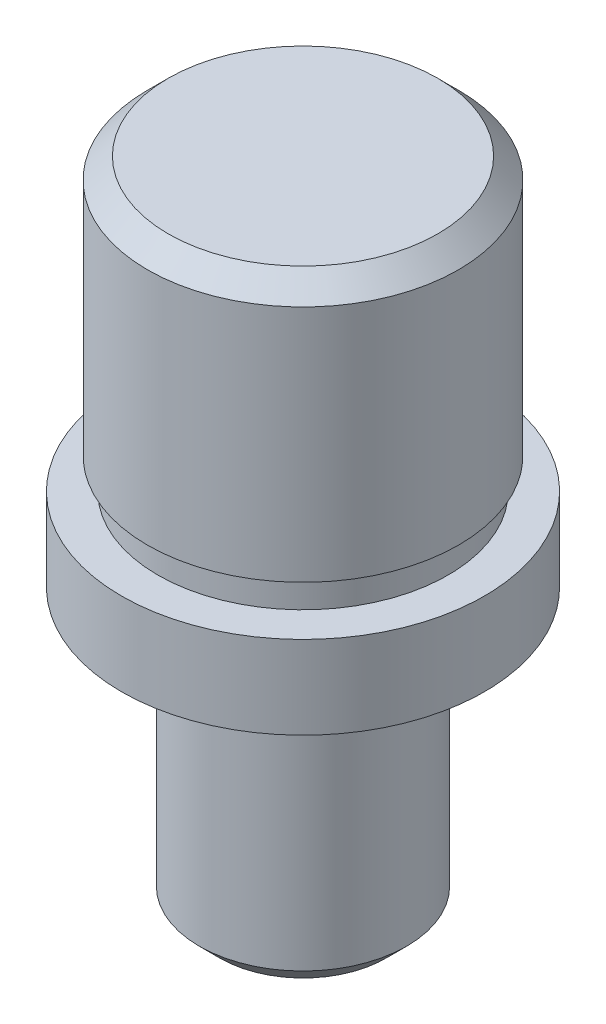
ISO-10303-21;
HEADER;
FILE_DESCRIPTION(('STEP AP214'),'2;1');
FILE_NAME('part.step','',(''),(''),'','','');
FILE_SCHEMA(('AUTOMOTIVE_DESIGN { 1 0 10303 214 1 1 1 1 }'));
ENDSEC;
DATA;
#1=APPLICATION_CONTEXT('core data for automotive mechanical design processes');
#2=APPLICATION_PROTOCOL_DEFINITION('international standard','automotive_design',2000,#1);
#3=PRODUCT_CONTEXT('',#1,'mechanical');
#4=PRODUCT('Part','Part','',(#3));
#5=PRODUCT_RELATED_PRODUCT_CATEGORY('part','',(#4));
#6=PRODUCT_DEFINITION_FORMATION('','',#4);
#7=PRODUCT_DEFINITION_CONTEXT('part definition',#1,'design');
#8=PRODUCT_DEFINITION('design','',#6,#7);
#9=PRODUCT_DEFINITION_SHAPE('','',#8);
#10=(LENGTH_UNIT() NAMED_UNIT(*) SI_UNIT(.MILLI.,.METRE.));
#11=(NAMED_UNIT(*) PLANE_ANGLE_UNIT() SI_UNIT($,.RADIAN.));
#12=(NAMED_UNIT(*) SI_UNIT($,.STERADIAN.) SOLID_ANGLE_UNIT());
#13=UNCERTAINTY_MEASURE_WITH_UNIT(LENGTH_MEASURE(1.E-05),#10,'distance_accuracy_value','');
#14=(GEOMETRIC_REPRESENTATION_CONTEXT(3) GLOBAL_UNCERTAINTY_ASSIGNED_CONTEXT((#13)) GLOBAL_UNIT_ASSIGNED_CONTEXT((#10,
#11,#12)) REPRESENTATION_CONTEXT('',''));
#15=CARTESIAN_POINT('',(0.,0.,0.));
#16=DIRECTION('',(0.,0.,1.));
#17=DIRECTION('',(1.,0.,0.));
#18=AXIS2_PLACEMENT_3D('',#15,#16,#17);
#19=CARTESIAN_POINT('',(0.,63.,0.));
#20=DIRECTION('',(0.,-1.,0.));
#21=DIRECTION('',(0.,0.,-1.));
#22=AXIS2_PLACEMENT_3D('',#19,#20,#21);
#23=CYLINDRICAL_SURFACE('',#22,17.5);
#24=CARTESIAN_POINT('',(0.,35.,0.));
#25=DIRECTION('',(0.,1.,0.));
#26=DIRECTION('',(0.,0.,1.));
#27=AXIS2_PLACEMENT_3D('',#24,#25,#26);
#28=CIRCLE('',#27,17.5);
#29=CARTESIAN_POINT('',(0.,35.,17.5));
#30=VERTEX_POINT('',#29);
#31=EDGE_CURVE('E57',#30,#30,#28,.T.);
#32=ORIENTED_EDGE('',*,*,#31,.F.);
#33=EDGE_LOOP('',(#32));
#34=FACE_BOUND('',#33,.T.);
#35=CARTESIAN_POINT('',(0.,27.,0.));
#36=DIRECTION('',(0.,-1.,0.));
#37=DIRECTION('',(0.,0.,-1.));
#38=AXIS2_PLACEMENT_3D('',#35,#36,#37);
#39=CIRCLE('',#38,17.5);
#40=CARTESIAN_POINT('',(0.,27.,-17.5));
#41=VERTEX_POINT('',#40);
#42=EDGE_CURVE('E58',#41,#41,#39,.T.);
#43=ORIENTED_EDGE('',*,*,#42,.F.);
#44=EDGE_LOOP('',(#43));
#45=FACE_BOUND('',#44,.T.);
#46=ADVANCED_FACE('F37',(#34,#45),#23,.T.);
#47=CARTESIAN_POINT('',(0.,35.,0.));
#48=DIRECTION('',(0.,1.,0.));
#49=DIRECTION('',(0.,0.,1.));
#50=AXIS2_PLACEMENT_3D('',#47,#48,#49);
#51=PLANE('',#50);
#52=CARTESIAN_POINT('',(0.,35.,0.));
#53=DIRECTION('',(0.,1.,0.));
#54=DIRECTION('',(0.,0.,1.));
#55=AXIS2_PLACEMENT_3D('',#52,#53,#54);
#56=CIRCLE('',#55,14.);
#57=CARTESIAN_POINT('',(0.,35.,14.));
#58=VERTEX_POINT('',#57);
#59=EDGE_CURVE('E68',#58,#58,#56,.T.);
#60=ORIENTED_EDGE('',*,*,#59,.F.);
#61=EDGE_LOOP('',(#60));
#62=FACE_BOUND('',#61,.T.);
#63=ORIENTED_EDGE('',*,*,#31,.T.);
#64=EDGE_LOOP('',(#63));
#65=FACE_BOUND('',#64,.T.);
#66=ADVANCED_FACE('F94',(#62,#65),#51,.T.);
#67=CARTESIAN_POINT('',(0.,38.,0.));
#68=DIRECTION('',(0.,1.,0.));
#69=DIRECTION('',(0.,0.,1.));
#70=AXIS2_PLACEMENT_3D('',#67,#68,#69);
#71=PLANE('',#70);
#72=CARTESIAN_POINT('',(0.,38.,0.));
#73=DIRECTION('',(0.,1.,0.));
#74=DIRECTION('',(0.,0.,1.));
#75=AXIS2_PLACEMENT_3D('',#72,#73,#74);
#76=CIRCLE('',#75,15.);
#77=CARTESIAN_POINT('',(0.,38.,15.));
#78=VERTEX_POINT('',#77);
#79=EDGE_CURVE('E65',#78,#78,#76,.F.);
#80=ORIENTED_EDGE('',*,*,#79,.T.);
#81=EDGE_LOOP('',(#80));
#82=FACE_BOUND('',#81,.T.);
#83=CARTESIAN_POINT('',(0.,38.,0.));
#84=DIRECTION('',(0.,1.,0.));
#85=DIRECTION('',(0.,0.,1.));
#86=AXIS2_PLACEMENT_3D('',#83,#84,#85);
#87=CIRCLE('',#86,14.);
#88=CARTESIAN_POINT('',(0.,38.,14.));
#89=VERTEX_POINT('',#88);
#90=EDGE_CURVE('E61',#89,#89,#87,.T.);
#91=ORIENTED_EDGE('',*,*,#90,.T.);
#92=EDGE_LOOP('',(#91));
#93=FACE_BOUND('',#92,.T.);
#94=ADVANCED_FACE('F100',(#82,#93),#71,.F.);
#95=CARTESIAN_POINT('',(0.,35.,0.));
#96=DIRECTION('',(0.,1.,0.));
#97=DIRECTION('',(0.,0.,1.));
#98=AXIS2_PLACEMENT_3D('',#95,#96,#97);
#99=CYLINDRICAL_SURFACE('',#98,14.);
#100=ORIENTED_EDGE('',*,*,#59,.T.);
#101=EDGE_LOOP('',(#100));
#102=FACE_BOUND('',#101,.T.);
#103=ORIENTED_EDGE('',*,*,#90,.F.);
#104=EDGE_LOOP('',(#103));
#105=FACE_BOUND('',#104,.T.);
#106=ADVANCED_FACE('F123',(#102,#105),#99,.T.);
#107=CARTESIAN_POINT('',(0.,63.,0.));
#108=DIRECTION('',(0.,1.,0.));
#109=DIRECTION('',(0.,0.,1.));
#110=AXIS2_PLACEMENT_3D('',#107,#108,#109);
#111=PLANE('',#110);
#112=CARTESIAN_POINT('',(0.,63.,0.));
#113=DIRECTION('',(0.,1.,0.));
#114=DIRECTION('',(0.,0.,1.));
#115=AXIS2_PLACEMENT_3D('',#112,#113,#114);
#116=CIRCLE('',#115,13.);
#117=CARTESIAN_POINT('',(0.,63.,13.));
#118=VERTEX_POINT('',#117);
#119=EDGE_CURVE('E52',#118,#118,#116,.T.);
#120=ORIENTED_EDGE('',*,*,#119,.T.);
#121=EDGE_LOOP('',(#120));
#122=FACE_BOUND('',#121,.T.);
#123=ADVANCED_FACE('F121',(#122),#111,.T.);
#124=CARTESIAN_POINT('',(0.,38.,0.));
#125=DIRECTION('',(0.,1.,0.));
#126=DIRECTION('',(0.,0.,1.));
#127=AXIS2_PLACEMENT_3D('',#124,#125,#126);
#128=CYLINDRICAL_SURFACE('',#127,15.);
#129=CARTESIAN_POINT('',(0.,61.,0.));
#130=DIRECTION('',(0.,1.,0.));
#131=DIRECTION('',(0.,0.,1.));
#132=AXIS2_PLACEMENT_3D('',#129,#130,#131);
#133=CIRCLE('',#132,15.);
#134=CARTESIAN_POINT('',(0.,61.,15.));
#135=VERTEX_POINT('',#134);
#136=EDGE_CURVE('E48',#135,#135,#133,.F.);
#137=ORIENTED_EDGE('',*,*,#136,.T.);
#138=EDGE_LOOP('',(#137));
#139=FACE_BOUND('',#138,.T.);
#140=ORIENTED_EDGE('',*,*,#79,.F.);
#141=EDGE_LOOP('',(#140));
#142=FACE_BOUND('',#141,.T.);
#143=ADVANCED_FACE('F89',(#139,#142),#128,.T.);
#144=CARTESIAN_POINT('',(0.,27.,0.));
#145=DIRECTION('',(0.,-1.,0.));
#146=DIRECTION('',(0.,0.,-1.));
#147=AXIS2_PLACEMENT_3D('',#144,#145,#146);
#148=PLANE('',#147);
#149=CARTESIAN_POINT('',(0.,27.,0.));
#150=DIRECTION('',(0.,-1.,0.));
#151=DIRECTION('',(0.,0.,-1.));
#152=AXIS2_PLACEMENT_3D('',#149,#150,#151);
#153=CIRCLE('',#152,9.);
#154=CARTESIAN_POINT('',(0.,27.,-9.));
#155=VERTEX_POINT('',#154);
#156=EDGE_CURVE('E75',#155,#155,#153,.T.);
#157=ORIENTED_EDGE('',*,*,#156,.F.);
#158=EDGE_LOOP('',(#157));
#159=FACE_BOUND('',#158,.T.);
#160=ORIENTED_EDGE('',*,*,#42,.T.);
#161=EDGE_LOOP('',(#160));
#162=FACE_BOUND('',#161,.T.);
#163=ADVANCED_FACE('F85',(#159,#162),#148,.T.);
#164=CARTESIAN_POINT('',(0.,25.,0.));
#165=DIRECTION('',(0.,-1.,0.));
#166=DIRECTION('',(0.,0.,-1.));
#167=AXIS2_PLACEMENT_3D('',#164,#165,#166);
#168=PLANE('',#167);
#169=CARTESIAN_POINT('',(0.,25.,0.));
#170=DIRECTION('',(0.,-1.,0.));
#171=DIRECTION('',(0.,0.,-1.));
#172=AXIS2_PLACEMENT_3D('',#169,#170,#171);
#173=CIRCLE('',#172,10.);
#174=CARTESIAN_POINT('',(0.,25.,-10.));
#175=VERTEX_POINT('',#174);
#176=EDGE_CURVE('E62',#175,#175,#173,.F.);
#177=ORIENTED_EDGE('',*,*,#176,.T.);
#178=EDGE_LOOP('',(#177));
#179=FACE_BOUND('',#178,.T.);
#180=CARTESIAN_POINT('',(0.,25.,0.));
#181=DIRECTION('',(0.,-1.,0.));
#182=DIRECTION('',(0.,0.,-1.));
#183=AXIS2_PLACEMENT_3D('',#180,#181,#182);
#184=CIRCLE('',#183,9.);
#185=CARTESIAN_POINT('',(0.,25.,-9.));
#186=VERTEX_POINT('',#185);
#187=EDGE_CURVE('E76',#186,#186,#184,.T.);
#188=ORIENTED_EDGE('',*,*,#187,.T.);
#189=EDGE_LOOP('',(#188));
#190=FACE_BOUND('',#189,.T.);
#191=ADVANCED_FACE('F88',(#179,#190),#168,.F.);
#192=CARTESIAN_POINT('',(0.,27.,0.));
#193=DIRECTION('',(0.,-1.,0.));
#194=DIRECTION('',(0.,0.,-1.));
#195=AXIS2_PLACEMENT_3D('',#192,#193,#194);
#196=CYLINDRICAL_SURFACE('',#195,9.);
#197=ORIENTED_EDGE('',*,*,#156,.T.);
#198=EDGE_LOOP('',(#197));
#199=FACE_BOUND('',#198,.T.);
#200=ORIENTED_EDGE('',*,*,#187,.F.);
#201=EDGE_LOOP('',(#200));
#202=FACE_BOUND('',#201,.T.);
#203=ADVANCED_FACE('F82',(#199,#202),#196,.T.);
#204=CARTESIAN_POINT('',(0.,0.,0.));
#205=DIRECTION('',(0.,1.,0.));
#206=DIRECTION('',(0.,0.,1.));
#207=AXIS2_PLACEMENT_3D('',#204,#205,#206);
#208=PLANE('',#207);
#209=CARTESIAN_POINT('',(0.,0.,0.));
#210=DIRECTION('',(0.,1.,0.));
#211=DIRECTION('',(0.,0.,1.));
#212=AXIS2_PLACEMENT_3D('',#209,#210,#211);
#213=CIRCLE('',#212,7.99999999999999);
#214=CARTESIAN_POINT('',(0.,0.,7.99999999999999));
#215=VERTEX_POINT('',#214);
#216=EDGE_CURVE('E44',#215,#215,#213,.F.);
#217=ORIENTED_EDGE('',*,*,#216,.T.);
#218=EDGE_LOOP('',(#217));
#219=FACE_BOUND('',#218,.T.);
#220=ADVANCED_FACE('F105',(#219),#208,.F.);
#221=CARTESIAN_POINT('',(0.,25.,0.));
#222=DIRECTION('',(0.,-1.,0.));
#223=DIRECTION('',(0.,0.,-1.));
#224=AXIS2_PLACEMENT_3D('',#221,#222,#223);
#225=CYLINDRICAL_SURFACE('',#224,10.);
#226=CARTESIAN_POINT('',(0.,2.00000000000001,0.));
#227=DIRECTION('',(0.,1.,0.));
#228=DIRECTION('',(0.,0.,1.));
#229=AXIS2_PLACEMENT_3D('',#226,#227,#228);
#230=CIRCLE('',#229,10.);
#231=CARTESIAN_POINT('',(0.,2.00000000000001,10.));
#232=VERTEX_POINT('',#231);
#233=EDGE_CURVE('E11',#232,#232,#230,.T.);
#234=ORIENTED_EDGE('',*,*,#233,.T.);
#235=EDGE_LOOP('',(#234));
#236=FACE_BOUND('',#235,.T.);
#237=ORIENTED_EDGE('',*,*,#176,.F.);
#238=EDGE_LOOP('',(#237));
#239=FACE_BOUND('',#238,.T.);
#240=ADVANCED_FACE('F109',(#236,#239),#225,.T.);
#241=CARTESIAN_POINT('',(0.,63.,0.));
#242=DIRECTION('',(0.,-1.,0.));
#243=DIRECTION('',(0.,0.,-1.));
#244=AXIS2_PLACEMENT_3D('',#241,#242,#243);
#245=CONICAL_SURFACE('',#244,13.,0.785398163397445);
#246=ORIENTED_EDGE('',*,*,#136,.F.);
#247=EDGE_LOOP('',(#246));
#248=FACE_BOUND('',#247,.T.);
#249=ORIENTED_EDGE('',*,*,#119,.F.);
#250=EDGE_LOOP('',(#249));
#251=FACE_BOUND('',#250,.T.);
#252=ADVANCED_FACE('F107',(#248,#251),#245,.T.);
#253=CARTESIAN_POINT('',(0.,0.,0.));
#254=DIRECTION('',(0.,1.,0.));
#255=DIRECTION('',(0.,0.,1.));
#256=AXIS2_PLACEMENT_3D('',#253,#254,#255);
#257=CONICAL_SURFACE('',#256,7.99999999999999,0.785398163397448);
#258=ORIENTED_EDGE('',*,*,#233,.F.);
#259=EDGE_LOOP('',(#258));
#260=FACE_BOUND('',#259,.T.);
#261=ORIENTED_EDGE('',*,*,#216,.F.);
#262=EDGE_LOOP('',(#261));
#263=FACE_BOUND('',#262,.T.);
#264=ADVANCED_FACE('F39',(#260,#263),#257,.T.);
#265=CLOSED_SHELL('',(#46,#66,#94,#106,#123,#143,#163,#191,#203,#220,#240,#252,#264));
#266=MANIFOLD_SOLID_BREP('B2',#265);
#267=ADVANCED_BREP_SHAPE_REPRESENTATION('',(#18,#266),#14);
#268=SHAPE_DEFINITION_REPRESENTATION(#9,#267);
ENDSEC;
END-ISO-10303-21;
